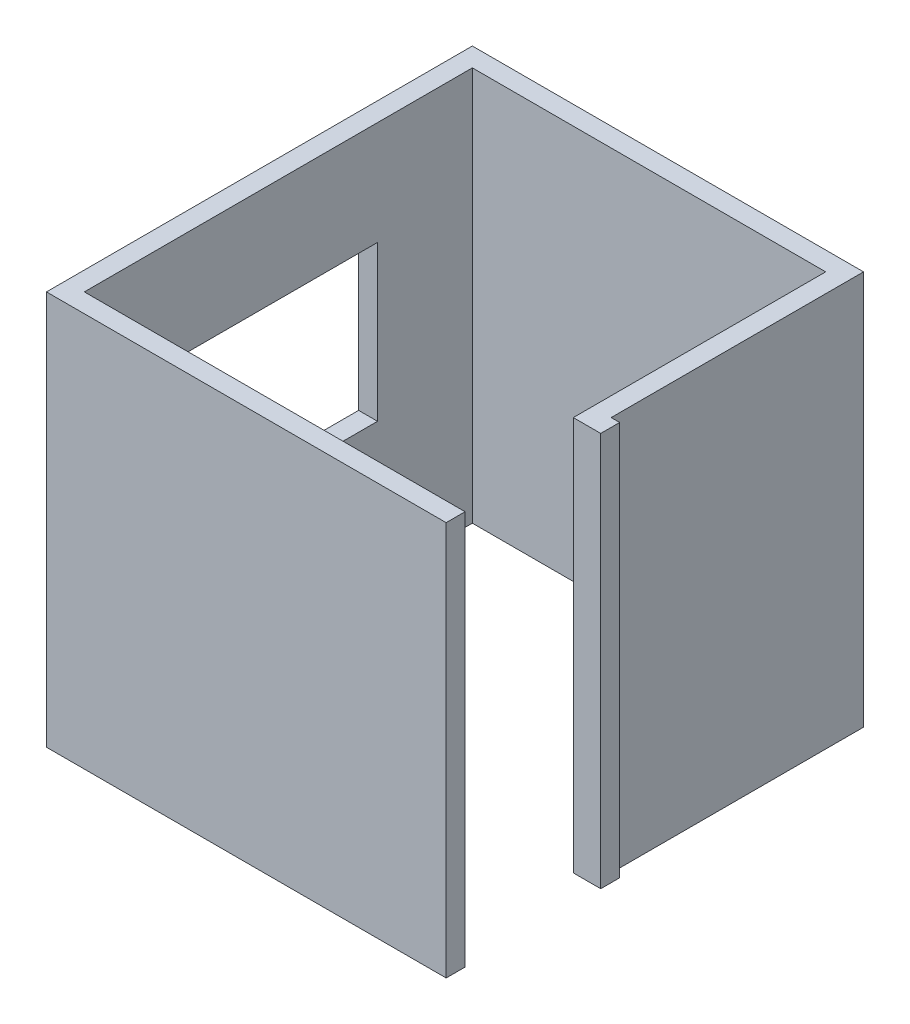
ISO-10303-21;
HEADER;
FILE_DESCRIPTION(('STEP AP214'),'2;1');
FILE_NAME('part.step','',(''),(''),'','','');
FILE_SCHEMA(('AUTOMOTIVE_DESIGN { 1 0 10303 214 1 1 1 1 }'));
ENDSEC;
DATA;
#1=APPLICATION_CONTEXT('core data for automotive mechanical design processes');
#2=APPLICATION_PROTOCOL_DEFINITION('international standard','automotive_design',2000,#1);
#3=PRODUCT_CONTEXT('',#1,'mechanical');
#4=PRODUCT('Part','Part','',(#3));
#5=PRODUCT_RELATED_PRODUCT_CATEGORY('part','',(#4));
#6=PRODUCT_DEFINITION_FORMATION('','',#4);
#7=PRODUCT_DEFINITION_CONTEXT('part definition',#1,'design');
#8=PRODUCT_DEFINITION('design','',#6,#7);
#9=PRODUCT_DEFINITION_SHAPE('','',#8);
#10=(LENGTH_UNIT() NAMED_UNIT(*) SI_UNIT(.MILLI.,.METRE.));
#11=(NAMED_UNIT(*) PLANE_ANGLE_UNIT() SI_UNIT($,.RADIAN.));
#12=(NAMED_UNIT(*) SI_UNIT($,.STERADIAN.) SOLID_ANGLE_UNIT());
#13=UNCERTAINTY_MEASURE_WITH_UNIT(LENGTH_MEASURE(1.E-05),#10,'distance_accuracy_value','');
#14=(GEOMETRIC_REPRESENTATION_CONTEXT(3) GLOBAL_UNCERTAINTY_ASSIGNED_CONTEXT((#13)) GLOBAL_UNIT_ASSIGNED_CONTEXT((#10,
#11,#12)) REPRESENTATION_CONTEXT('',''));
#15=CARTESIAN_POINT('',(0.,0.,0.));
#16=DIRECTION('',(0.,0.,1.));
#17=DIRECTION('',(1.,0.,0.));
#18=AXIS2_PLACEMENT_3D('',#15,#16,#17);
#19=CARTESIAN_POINT('',(0.,2500.,120.));
#20=DIRECTION('',(0.,0.,-1.));
#21=DIRECTION('',(-1.,0.,0.));
#22=AXIS2_PLACEMENT_3D('',#19,#20,#21);
#23=PLANE('',#22);
#24=DIRECTION('',(1.,0.,0.));
#25=VECTOR('',#24,1.);
#26=CARTESIAN_POINT('',(0.,0.,120.));
#27=LINE('',#26,#25);
#28=CARTESIAN_POINT('',(-120.,0.,120.));
#29=VERTEX_POINT('',#28);
#30=CARTESIAN_POINT('',(2413.94082575557,0.,120.));
#31=VERTEX_POINT('',#30);
#32=EDGE_CURVE('E172',#29,#31,#27,.T.);
#33=ORIENTED_EDGE('',*,*,#32,.T.);
#34=DIRECTION('',(0.,-1.,0.));
#35=VECTOR('',#34,1.);
#36=CARTESIAN_POINT('',(2413.94082575557,2500.,120.));
#37=LINE('',#36,#35);
#38=CARTESIAN_POINT('',(2413.94082575557,2500.,120.));
#39=VERTEX_POINT('',#38);
#40=EDGE_CURVE('E11',#39,#31,#37,.T.);
#41=ORIENTED_EDGE('',*,*,#40,.F.);
#42=DIRECTION('',(1.,0.,0.));
#43=VECTOR('',#42,1.);
#44=CARTESIAN_POINT('',(0.,2500.,120.));
#45=LINE('',#44,#43);
#46=CARTESIAN_POINT('',(-120.,2500.,120.));
#47=VERTEX_POINT('',#46);
#48=EDGE_CURVE('E182',#47,#39,#45,.T.);
#49=ORIENTED_EDGE('',*,*,#48,.F.);
#50=DIRECTION('',(0.,-1.,0.));
#51=VECTOR('',#50,1.);
#52=CARTESIAN_POINT('',(-120.,2500.,120.));
#53=LINE('',#52,#51);
#54=EDGE_CURVE('E214',#47,#29,#53,.T.);
#55=ORIENTED_EDGE('',*,*,#54,.T.);
#56=EDGE_LOOP('',(#33,#41,#49,#55));
#57=FACE_BOUND('',#56,.T.);
#58=ADVANCED_FACE('F36',(#57),#23,.F.);
#59=CARTESIAN_POINT('',(2413.94082575557,2500.,0.));
#60=DIRECTION('',(1.,0.,0.));
#61=DIRECTION('',(0.,0.,-1.));
#62=AXIS2_PLACEMENT_3D('',#59,#60,#61);
#63=PLANE('',#62);
#64=DIRECTION('',(0.,0.,1.));
#65=VECTOR('',#64,1.);
#66=CARTESIAN_POINT('',(2413.94082575557,0.,0.));
#67=LINE('',#66,#65);
#68=CARTESIAN_POINT('',(2413.94082575557,0.,0.));
#69=VERTEX_POINT('',#68);
#70=EDGE_CURVE('E217',#69,#31,#67,.T.);
#71=ORIENTED_EDGE('',*,*,#70,.F.);
#72=DIRECTION('',(0.,-1.,0.));
#73=VECTOR('',#72,1.);
#74=CARTESIAN_POINT('',(2413.94082575557,2500.,0.));
#75=LINE('',#74,#73);
#76=CARTESIAN_POINT('',(2413.94082575557,2500.,0.));
#77=VERTEX_POINT('',#76);
#78=EDGE_CURVE('E43',#77,#69,#75,.T.);
#79=ORIENTED_EDGE('',*,*,#78,.F.);
#80=DIRECTION('',(0.,0.,1.));
#81=VECTOR('',#80,1.);
#82=CARTESIAN_POINT('',(2413.94082575557,2500.,0.));
#83=LINE('',#82,#81);
#84=EDGE_CURVE('E184',#77,#39,#83,.T.);
#85=ORIENTED_EDGE('',*,*,#84,.T.);
#86=ORIENTED_EDGE('',*,*,#40,.T.);
#87=EDGE_LOOP('',(#71,#79,#85,#86));
#88=FACE_BOUND('',#87,.T.);
#89=ADVANCED_FACE('F274',(#88),#63,.T.);
#90=CARTESIAN_POINT('',(0.,2500.,0.));
#91=DIRECTION('',(0.,0.,-1.));
#92=DIRECTION('',(-1.,0.,0.));
#93=AXIS2_PLACEMENT_3D('',#90,#91,#92);
#94=PLANE('',#93);
#95=DIRECTION('',(1.,0.,0.));
#96=VECTOR('',#95,1.);
#97=CARTESIAN_POINT('',(0.,0.,0.));
#98=LINE('',#97,#96);
#99=CARTESIAN_POINT('',(0.,0.,0.));
#100=VERTEX_POINT('',#99);
#101=EDGE_CURVE('E220',#100,#69,#98,.T.);
#102=ORIENTED_EDGE('',*,*,#101,.F.);
#103=DIRECTION('',(0.,-1.,0.));
#104=VECTOR('',#103,1.);
#105=CARTESIAN_POINT('',(0.,2500.,0.));
#106=LINE('',#105,#104);
#107=CARTESIAN_POINT('',(0.,2500.,0.));
#108=VERTEX_POINT('',#107);
#109=EDGE_CURVE('E266',#108,#100,#106,.T.);
#110=ORIENTED_EDGE('',*,*,#109,.F.);
#111=DIRECTION('',(1.,0.,0.));
#112=VECTOR('',#111,1.);
#113=CARTESIAN_POINT('',(0.,2500.,0.));
#114=LINE('',#113,#112);
#115=EDGE_CURVE('E188',#108,#77,#114,.T.);
#116=ORIENTED_EDGE('',*,*,#115,.T.);
#117=ORIENTED_EDGE('',*,*,#78,.T.);
#118=EDGE_LOOP('',(#102,#110,#116,#117));
#119=FACE_BOUND('',#118,.T.);
#120=ADVANCED_FACE('F270',(#119),#94,.T.);
#121=CARTESIAN_POINT('',(0.,2500.,0.));
#122=DIRECTION('',(1.,0.,0.));
#123=DIRECTION('',(0.,0.,-1.));
#124=AXIS2_PLACEMENT_3D('',#121,#122,#123);
#125=PLANE('',#124);
#126=DIRECTION('',(0.,-1.,0.));
#127=VECTOR('',#126,1.);
#128=CARTESIAN_POINT('',(0.,1842.1460593985,-1859.));
#129=LINE('',#128,#127);
#130=CARTESIAN_POINT('',(0.,1842.1460593985,-1859.));
#131=VERTEX_POINT('',#130);
#132=CARTESIAN_POINT('',(0.,860.,-1859.));
#133=VERTEX_POINT('',#132);
#134=EDGE_CURVE('E161',#131,#133,#129,.T.);
#135=ORIENTED_EDGE('',*,*,#134,.T.);
#136=DIRECTION('',(0.,0.,1.));
#137=VECTOR('',#136,1.);
#138=CARTESIAN_POINT('',(0.,860.,-1859.));
#139=LINE('',#138,#137);
#140=CARTESIAN_POINT('',(0.,860.,-489.));
#141=VERTEX_POINT('',#140);
#142=EDGE_CURVE('E155',#133,#141,#139,.T.);
#143=ORIENTED_EDGE('',*,*,#142,.T.);
#144=DIRECTION('',(0.,1.,0.));
#145=VECTOR('',#144,1.);
#146=CARTESIAN_POINT('',(0.,1842.1460593985,-489.));
#147=LINE('',#146,#145);
#148=CARTESIAN_POINT('',(0.,1842.1460593985,-489.));
#149=VERTEX_POINT('',#148);
#150=EDGE_CURVE('E146',#141,#149,#147,.T.);
#151=ORIENTED_EDGE('',*,*,#150,.T.);
#152=DIRECTION('',(0.,0.,-1.));
#153=VECTOR('',#152,1.);
#154=CARTESIAN_POINT('',(0.,1842.1460593985,-1859.));
#155=LINE('',#154,#153);
#156=EDGE_CURVE('E164',#149,#131,#155,.T.);
#157=ORIENTED_EDGE('',*,*,#156,.T.);
#158=EDGE_LOOP('',(#135,#143,#151,#157));
#159=FACE_BOUND('',#158,.T.);
#160=DIRECTION('',(0.,0.,1.));
#161=VECTOR('',#160,1.);
#162=CARTESIAN_POINT('',(0.,0.,0.));
#163=LINE('',#162,#161);
#164=CARTESIAN_POINT('',(0.,0.,-2460.));
#165=VERTEX_POINT('',#164);
#166=EDGE_CURVE('E223',#165,#100,#163,.T.);
#167=ORIENTED_EDGE('',*,*,#166,.F.);
#168=DIRECTION('',(0.,-1.,0.));
#169=VECTOR('',#168,1.);
#170=CARTESIAN_POINT('',(0.,2500.,-2460.));
#171=LINE('',#170,#169);
#172=CARTESIAN_POINT('',(0.,2500.,-2460.));
#173=VERTEX_POINT('',#172);
#174=EDGE_CURVE('E264',#173,#165,#171,.T.);
#175=ORIENTED_EDGE('',*,*,#174,.F.);
#176=DIRECTION('',(0.,0.,1.));
#177=VECTOR('',#176,1.);
#178=CARTESIAN_POINT('',(0.,2500.,0.));
#179=LINE('',#178,#177);
#180=EDGE_CURVE('E191',#173,#108,#179,.T.);
#181=ORIENTED_EDGE('',*,*,#180,.T.);
#182=ORIENTED_EDGE('',*,*,#109,.T.);
#183=EDGE_LOOP('',(#167,#175,#181,#182));
#184=FACE_BOUND('',#183,.T.);
#185=ADVANCED_FACE('F159',(#159,#184),#125,.T.);
#186=CARTESIAN_POINT('',(0.,2500.,-2460.));
#187=DIRECTION('',(0.,0.,1.));
#188=DIRECTION('',(1.,0.,0.));
#189=AXIS2_PLACEMENT_3D('',#186,#187,#188);
#190=PLANE('',#189);
#191=DIRECTION('',(-1.,0.,0.));
#192=VECTOR('',#191,1.);
#193=CARTESIAN_POINT('',(0.,0.,-2460.));
#194=LINE('',#193,#192);
#195=CARTESIAN_POINT('',(2240.,0.,-2460.));
#196=VERTEX_POINT('',#195);
#197=EDGE_CURVE('E226',#196,#165,#194,.T.);
#198=ORIENTED_EDGE('',*,*,#197,.F.);
#199=DIRECTION('',(0.,-1.,0.));
#200=VECTOR('',#199,1.);
#201=CARTESIAN_POINT('',(2240.,2500.,-2460.));
#202=LINE('',#201,#200);
#203=CARTESIAN_POINT('',(2240.,2500.,-2460.));
#204=VERTEX_POINT('',#203);
#205=EDGE_CURVE('E262',#204,#196,#202,.T.);
#206=ORIENTED_EDGE('',*,*,#205,.F.);
#207=DIRECTION('',(-1.,0.,0.));
#208=VECTOR('',#207,1.);
#209=CARTESIAN_POINT('',(0.,2500.,-2460.));
#210=LINE('',#209,#208);
#211=EDGE_CURVE('E194',#204,#173,#210,.T.);
#212=ORIENTED_EDGE('',*,*,#211,.T.);
#213=ORIENTED_EDGE('',*,*,#174,.T.);
#214=EDGE_LOOP('',(#198,#206,#212,#213));
#215=FACE_BOUND('',#214,.T.);
#216=ADVANCED_FACE('F319',(#215),#190,.T.);
#217=CARTESIAN_POINT('',(2240.,2500.,-2460.));
#218=DIRECTION('',(-1.,0.,0.));
#219=DIRECTION('',(0.,0.,1.));
#220=AXIS2_PLACEMENT_3D('',#217,#218,#219);
#221=PLANE('',#220);
#222=DIRECTION('',(0.,0.,-1.));
#223=VECTOR('',#222,1.);
#224=CARTESIAN_POINT('',(2240.,0.,-2460.));
#225=LINE('',#224,#223);
#226=CARTESIAN_POINT('',(2240.,0.,-860.));
#227=VERTEX_POINT('',#226);
#228=EDGE_CURVE('E229',#227,#196,#225,.T.);
#229=ORIENTED_EDGE('',*,*,#228,.F.);
#230=DIRECTION('',(0.,-1.,0.));
#231=VECTOR('',#230,1.);
#232=CARTESIAN_POINT('',(2240.,2500.,-860.));
#233=LINE('',#232,#231);
#234=CARTESIAN_POINT('',(2240.,2500.,-860.));
#235=VERTEX_POINT('',#234);
#236=EDGE_CURVE('E260',#235,#227,#233,.T.);
#237=ORIENTED_EDGE('',*,*,#236,.F.);
#238=DIRECTION('',(0.,0.,-1.));
#239=VECTOR('',#238,1.);
#240=CARTESIAN_POINT('',(2240.,2500.,-2460.));
#241=LINE('',#240,#239);
#242=EDGE_CURVE('E197',#235,#204,#241,.T.);
#243=ORIENTED_EDGE('',*,*,#242,.T.);
#244=ORIENTED_EDGE('',*,*,#205,.T.);
#245=EDGE_LOOP('',(#229,#237,#243,#244));
#246=FACE_BOUND('',#245,.T.);
#247=ADVANCED_FACE('F316',(#246),#221,.T.);
#248=CARTESIAN_POINT('',(2240.,2500.,-860.));
#249=DIRECTION('',(0.,0.,1.));
#250=DIRECTION('',(1.,0.,0.));
#251=AXIS2_PLACEMENT_3D('',#248,#249,#250);
#252=PLANE('',#251);
#253=DIRECTION('',(-1.,0.,0.));
#254=VECTOR('',#253,1.);
#255=CARTESIAN_POINT('',(2240.,0.,-860.));
#256=LINE('',#255,#254);
#257=CARTESIAN_POINT('',(2413.94082575557,0.,-860.));
#258=VERTEX_POINT('',#257);
#259=EDGE_CURVE('E232',#258,#227,#256,.T.);
#260=ORIENTED_EDGE('',*,*,#259,.F.);
#261=DIRECTION('',(0.,-1.,0.));
#262=VECTOR('',#261,1.);
#263=CARTESIAN_POINT('',(2413.94082575557,2500.,-860.));
#264=LINE('',#263,#262);
#265=CARTESIAN_POINT('',(2413.94082575557,2500.,-860.));
#266=VERTEX_POINT('',#265);
#267=EDGE_CURVE('E258',#266,#258,#264,.T.);
#268=ORIENTED_EDGE('',*,*,#267,.F.);
#269=DIRECTION('',(-1.,0.,0.));
#270=VECTOR('',#269,1.);
#271=CARTESIAN_POINT('',(2240.,2500.,-860.));
#272=LINE('',#271,#270);
#273=EDGE_CURVE('E200',#266,#235,#272,.T.);
#274=ORIENTED_EDGE('',*,*,#273,.T.);
#275=ORIENTED_EDGE('',*,*,#236,.T.);
#276=EDGE_LOOP('',(#260,#268,#274,#275));
#277=FACE_BOUND('',#276,.T.);
#278=ADVANCED_FACE('F313',(#277),#252,.T.);
#279=CARTESIAN_POINT('',(2413.94082575557,2500.,-980.));
#280=DIRECTION('',(1.,0.,0.));
#281=DIRECTION('',(0.,0.,-1.));
#282=AXIS2_PLACEMENT_3D('',#279,#280,#281);
#283=PLANE('',#282);
#284=DIRECTION('',(0.,0.,1.));
#285=VECTOR('',#284,1.);
#286=CARTESIAN_POINT('',(2413.94082575557,0.,-980.));
#287=LINE('',#286,#285);
#288=CARTESIAN_POINT('',(2413.94082575557,0.,-980.));
#289=VERTEX_POINT('',#288);
#290=EDGE_CURVE('E235',#289,#258,#287,.T.);
#291=ORIENTED_EDGE('',*,*,#290,.F.);
#292=DIRECTION('',(0.,-1.,0.));
#293=VECTOR('',#292,1.);
#294=CARTESIAN_POINT('',(2413.94082575557,2500.,-980.));
#295=LINE('',#294,#293);
#296=CARTESIAN_POINT('',(2413.94082575557,2500.,-980.));
#297=VERTEX_POINT('',#296);
#298=EDGE_CURVE('E256',#297,#289,#295,.T.);
#299=ORIENTED_EDGE('',*,*,#298,.F.);
#300=DIRECTION('',(0.,0.,1.));
#301=VECTOR('',#300,1.);
#302=CARTESIAN_POINT('',(2413.94082575557,2500.,-980.));
#303=LINE('',#302,#301);
#304=EDGE_CURVE('E203',#297,#266,#303,.T.);
#305=ORIENTED_EDGE('',*,*,#304,.T.);
#306=ORIENTED_EDGE('',*,*,#267,.T.);
#307=EDGE_LOOP('',(#291,#299,#305,#306));
#308=FACE_BOUND('',#307,.T.);
#309=ADVANCED_FACE('F307',(#308),#283,.T.);
#310=CARTESIAN_POINT('',(2240.,2500.,-980.));
#311=DIRECTION('',(0.,0.,1.));
#312=DIRECTION('',(1.,0.,0.));
#313=AXIS2_PLACEMENT_3D('',#310,#311,#312);
#314=PLANE('',#313);
#315=DIRECTION('',(1.,0.,0.));
#316=VECTOR('',#315,1.);
#317=CARTESIAN_POINT('',(2240.,0.,-980.));
#318=LINE('',#317,#316);
#319=CARTESIAN_POINT('',(2360.,0.,-980.));
#320=VERTEX_POINT('',#319);
#321=EDGE_CURVE('E238',#289,#320,#318,.F.);
#322=ORIENTED_EDGE('',*,*,#321,.T.);
#323=DIRECTION('',(0.,-1.,0.));
#324=VECTOR('',#323,1.);
#325=CARTESIAN_POINT('',(2360.,2500.,-980.));
#326=LINE('',#325,#324);
#327=CARTESIAN_POINT('',(2360.,2500.,-980.));
#328=VERTEX_POINT('',#327);
#329=EDGE_CURVE('E253',#328,#320,#326,.T.);
#330=ORIENTED_EDGE('',*,*,#329,.F.);
#331=DIRECTION('',(1.,0.,0.));
#332=VECTOR('',#331,1.);
#333=CARTESIAN_POINT('',(2240.,2500.,-980.));
#334=LINE('',#333,#332);
#335=EDGE_CURVE('E206',#297,#328,#334,.F.);
#336=ORIENTED_EDGE('',*,*,#335,.F.);
#337=ORIENTED_EDGE('',*,*,#298,.T.);
#338=EDGE_LOOP('',(#322,#330,#336,#337));
#339=FACE_BOUND('',#338,.T.);
#340=ADVANCED_FACE('F320',(#339),#314,.F.);
#341=CARTESIAN_POINT('',(2360.,2500.,-2460.));
#342=DIRECTION('',(-1.,0.,0.));
#343=DIRECTION('',(0.,0.,1.));
#344=AXIS2_PLACEMENT_3D('',#341,#342,#343);
#345=PLANE('',#344);
#346=DIRECTION('',(0.,0.,-1.));
#347=VECTOR('',#346,1.);
#348=CARTESIAN_POINT('',(2360.,0.,-2460.));
#349=LINE('',#348,#347);
#350=CARTESIAN_POINT('',(2360.,0.,-2580.));
#351=VERTEX_POINT('',#350);
#352=EDGE_CURVE('E240',#320,#351,#349,.T.);
#353=ORIENTED_EDGE('',*,*,#352,.T.);
#354=DIRECTION('',(0.,-1.,0.));
#355=VECTOR('',#354,1.);
#356=CARTESIAN_POINT('',(2360.,2500.,-2580.));
#357=LINE('',#356,#355);
#358=CARTESIAN_POINT('',(2360.,2500.,-2580.));
#359=VERTEX_POINT('',#358);
#360=EDGE_CURVE('E250',#359,#351,#357,.T.);
#361=ORIENTED_EDGE('',*,*,#360,.F.);
#362=DIRECTION('',(0.,0.,-1.));
#363=VECTOR('',#362,1.);
#364=CARTESIAN_POINT('',(2360.,2500.,-2460.));
#365=LINE('',#364,#363);
#366=EDGE_CURVE('E208',#328,#359,#365,.T.);
#367=ORIENTED_EDGE('',*,*,#366,.F.);
#368=ORIENTED_EDGE('',*,*,#329,.T.);
#369=EDGE_LOOP('',(#353,#361,#367,#368));
#370=FACE_BOUND('',#369,.T.);
#371=ADVANCED_FACE('F301',(#370),#345,.F.);
#372=CARTESIAN_POINT('',(0.,2500.,-2580.));
#373=DIRECTION('',(0.,0.,1.));
#374=DIRECTION('',(1.,0.,0.));
#375=AXIS2_PLACEMENT_3D('',#372,#373,#374);
#376=PLANE('',#375);
#377=DIRECTION('',(1.,0.,0.));
#378=VECTOR('',#377,1.);
#379=CARTESIAN_POINT('',(0.,0.,-2580.));
#380=LINE('',#379,#378);
#381=CARTESIAN_POINT('',(-120.,0.,-2580.));
#382=VERTEX_POINT('',#381);
#383=EDGE_CURVE('E242',#351,#382,#380,.F.);
#384=ORIENTED_EDGE('',*,*,#383,.T.);
#385=DIRECTION('',(0.,-1.,0.));
#386=VECTOR('',#385,1.);
#387=CARTESIAN_POINT('',(-120.,2500.,-2580.));
#388=LINE('',#387,#386);
#389=CARTESIAN_POINT('',(-120.,2500.,-2580.));
#390=VERTEX_POINT('',#389);
#391=EDGE_CURVE('E247',#390,#382,#388,.T.);
#392=ORIENTED_EDGE('',*,*,#391,.F.);
#393=DIRECTION('',(1.,0.,0.));
#394=VECTOR('',#393,1.);
#395=CARTESIAN_POINT('',(0.,2500.,-2580.));
#396=LINE('',#395,#394);
#397=EDGE_CURVE('E210',#359,#390,#396,.F.);
#398=ORIENTED_EDGE('',*,*,#397,.F.);
#399=ORIENTED_EDGE('',*,*,#360,.T.);
#400=EDGE_LOOP('',(#384,#392,#398,#399));
#401=FACE_BOUND('',#400,.T.);
#402=ADVANCED_FACE('F297',(#401),#376,.F.);
#403=CARTESIAN_POINT('',(-120.,2500.,0.));
#404=DIRECTION('',(1.,0.,0.));
#405=DIRECTION('',(0.,0.,-1.));
#406=AXIS2_PLACEMENT_3D('',#403,#404,#405);
#407=PLANE('',#406);
#408=DIRECTION('',(0.,0.,1.));
#409=VECTOR('',#408,1.);
#410=CARTESIAN_POINT('',(-120.,860.,-1859.));
#411=LINE('',#410,#409);
#412=CARTESIAN_POINT('',(-120.,860.,-1859.));
#413=VERTEX_POINT('',#412);
#414=CARTESIAN_POINT('',(-120.,860.,-489.));
#415=VERTEX_POINT('',#414);
#416=EDGE_CURVE('E58',#413,#415,#411,.T.);
#417=ORIENTED_EDGE('',*,*,#416,.F.);
#418=DIRECTION('',(0.,-1.,0.));
#419=VECTOR('',#418,1.);
#420=CARTESIAN_POINT('',(-120.,1842.1460593985,-1859.));
#421=LINE('',#420,#419);
#422=CARTESIAN_POINT('',(-120.,1842.1460593985,-1859.));
#423=VERTEX_POINT('',#422);
#424=EDGE_CURVE('E168',#423,#413,#421,.T.);
#425=ORIENTED_EDGE('',*,*,#424,.F.);
#426=DIRECTION('',(0.,0.,-1.));
#427=VECTOR('',#426,1.);
#428=CARTESIAN_POINT('',(-120.,1842.1460593985,-1859.));
#429=LINE('',#428,#427);
#430=CARTESIAN_POINT('',(-120.,1842.1460593985,-489.));
#431=VERTEX_POINT('',#430);
#432=EDGE_CURVE('E169',#431,#423,#429,.T.);
#433=ORIENTED_EDGE('',*,*,#432,.F.);
#434=DIRECTION('',(0.,1.,0.));
#435=VECTOR('',#434,1.);
#436=CARTESIAN_POINT('',(-120.,1842.1460593985,-489.));
#437=LINE('',#436,#435);
#438=EDGE_CURVE('E173',#415,#431,#437,.T.);
#439=ORIENTED_EDGE('',*,*,#438,.F.);
#440=EDGE_LOOP('',(#417,#425,#433,#439));
#441=FACE_BOUND('',#440,.T.);
#442=DIRECTION('',(0.,0.,-1.));
#443=VECTOR('',#442,1.);
#444=CARTESIAN_POINT('',(-120.,0.,0.));
#445=LINE('',#444,#443);
#446=EDGE_CURVE('E185',#382,#29,#445,.F.);
#447=ORIENTED_EDGE('',*,*,#446,.T.);
#448=ORIENTED_EDGE('',*,*,#54,.F.);
#449=DIRECTION('',(0.,0.,-1.));
#450=VECTOR('',#449,1.);
#451=CARTESIAN_POINT('',(-120.,2500.,0.));
#452=LINE('',#451,#450);
#453=EDGE_CURVE('E212',#390,#47,#452,.F.);
#454=ORIENTED_EDGE('',*,*,#453,.F.);
#455=ORIENTED_EDGE('',*,*,#391,.T.);
#456=EDGE_LOOP('',(#447,#448,#454,#455));
#457=FACE_BOUND('',#456,.T.);
#458=ADVANCED_FACE('F293',(#441,#457),#407,.F.);
#459=CARTESIAN_POINT('',(0.,2500.,0.));
#460=DIRECTION('',(0.,-1.,0.));
#461=DIRECTION('',(-1.,0.,0.));
#462=AXIS2_PLACEMENT_3D('',#459,#460,#461);
#463=PLANE('',#462);
#464=ORIENTED_EDGE('',*,*,#48,.T.);
#465=ORIENTED_EDGE('',*,*,#84,.F.);
#466=ORIENTED_EDGE('',*,*,#115,.F.);
#467=ORIENTED_EDGE('',*,*,#180,.F.);
#468=ORIENTED_EDGE('',*,*,#211,.F.);
#469=ORIENTED_EDGE('',*,*,#242,.F.);
#470=ORIENTED_EDGE('',*,*,#273,.F.);
#471=ORIENTED_EDGE('',*,*,#304,.F.);
#472=ORIENTED_EDGE('',*,*,#335,.T.);
#473=ORIENTED_EDGE('',*,*,#366,.T.);
#474=ORIENTED_EDGE('',*,*,#397,.T.);
#475=ORIENTED_EDGE('',*,*,#453,.T.);
#476=EDGE_LOOP('',(#464,#465,#466,#467,#468,#469,#470,#471,#472,#473,#474,#475));
#477=FACE_BOUND('',#476,.T.);
#478=ADVANCED_FACE('F283',(#477),#463,.F.);
#479=CARTESIAN_POINT('',(0.,0.,0.));
#480=DIRECTION('',(0.,-1.,0.));
#481=DIRECTION('',(-1.,0.,0.));
#482=AXIS2_PLACEMENT_3D('',#479,#480,#481);
#483=PLANE('',#482);
#484=ORIENTED_EDGE('',*,*,#32,.F.);
#485=ORIENTED_EDGE('',*,*,#446,.F.);
#486=ORIENTED_EDGE('',*,*,#383,.F.);
#487=ORIENTED_EDGE('',*,*,#352,.F.);
#488=ORIENTED_EDGE('',*,*,#321,.F.);
#489=ORIENTED_EDGE('',*,*,#290,.T.);
#490=ORIENTED_EDGE('',*,*,#259,.T.);
#491=ORIENTED_EDGE('',*,*,#228,.T.);
#492=ORIENTED_EDGE('',*,*,#197,.T.);
#493=ORIENTED_EDGE('',*,*,#166,.T.);
#494=ORIENTED_EDGE('',*,*,#101,.T.);
#495=ORIENTED_EDGE('',*,*,#70,.T.);
#496=EDGE_LOOP('',(#484,#485,#486,#487,#488,#489,#490,#491,#492,#493,#494,#495));
#497=FACE_BOUND('',#496,.T.);
#498=ADVANCED_FACE('F278',(#497),#483,.T.);
#499=CARTESIAN_POINT('',(2413.94182575557,1842.1460593985,-1859.));
#500=DIRECTION('',(0.,0.,-1.));
#501=DIRECTION('',(0.,1.,0.));
#502=AXIS2_PLACEMENT_3D('',#499,#500,#501);
#503=PLANE('',#502);
#504=DIRECTION('',(-1.,0.,0.));
#505=VECTOR('',#504,1.);
#506=CARTESIAN_POINT('',(2413.94182575557,1842.1460593985,-1859.));
#507=LINE('',#506,#505);
#508=EDGE_CURVE('E162',#131,#423,#507,.T.);
#509=ORIENTED_EDGE('',*,*,#508,.T.);
#510=ORIENTED_EDGE('',*,*,#424,.T.);
#511=DIRECTION('',(-1.,0.,0.));
#512=VECTOR('',#511,1.);
#513=CARTESIAN_POINT('',(2413.94182575557,860.,-1859.));
#514=LINE('',#513,#512);
#515=EDGE_CURVE('E179',#133,#413,#514,.T.);
#516=ORIENTED_EDGE('',*,*,#515,.F.);
#517=ORIENTED_EDGE('',*,*,#134,.F.);
#518=EDGE_LOOP('',(#509,#510,#516,#517));
#519=FACE_BOUND('',#518,.T.);
#520=ADVANCED_FACE('F390',(#519),#503,.F.);
#521=CARTESIAN_POINT('',(2413.94182575557,1842.1460593985,-1859.));
#522=DIRECTION('',(0.,1.,0.));
#523=DIRECTION('',(0.,0.,1.));
#524=AXIS2_PLACEMENT_3D('',#521,#522,#523);
#525=PLANE('',#524);
#526=DIRECTION('',(-1.,0.,0.));
#527=VECTOR('',#526,1.);
#528=CARTESIAN_POINT('',(2413.94182575557,1842.1460593985,-489.));
#529=LINE('',#528,#527);
#530=EDGE_CURVE('E50',#149,#431,#529,.T.);
#531=ORIENTED_EDGE('',*,*,#530,.T.);
#532=ORIENTED_EDGE('',*,*,#432,.T.);
#533=ORIENTED_EDGE('',*,*,#508,.F.);
#534=ORIENTED_EDGE('',*,*,#156,.F.);
#535=EDGE_LOOP('',(#531,#532,#533,#534));
#536=FACE_BOUND('',#535,.T.);
#537=ADVANCED_FACE('F414',(#536),#525,.F.);
#538=CARTESIAN_POINT('',(2413.94182575557,860.,-1859.));
#539=DIRECTION('',(0.,-1.,0.));
#540=DIRECTION('',(0.,0.,-1.));
#541=AXIS2_PLACEMENT_3D('',#538,#539,#540);
#542=PLANE('',#541);
#543=ORIENTED_EDGE('',*,*,#515,.T.);
#544=ORIENTED_EDGE('',*,*,#416,.T.);
#545=DIRECTION('',(-1.,0.,0.));
#546=VECTOR('',#545,1.);
#547=CARTESIAN_POINT('',(2413.94182575557,860.,-489.));
#548=LINE('',#547,#546);
#549=EDGE_CURVE('E148',#141,#415,#548,.T.);
#550=ORIENTED_EDGE('',*,*,#549,.F.);
#551=ORIENTED_EDGE('',*,*,#142,.F.);
#552=EDGE_LOOP('',(#543,#544,#550,#551));
#553=FACE_BOUND('',#552,.T.);
#554=ADVANCED_FACE('F154',(#553),#542,.F.);
#555=CARTESIAN_POINT('',(2413.94182575557,1842.1460593985,-489.));
#556=DIRECTION('',(0.,0.,1.));
#557=DIRECTION('',(0.,-1.,0.));
#558=AXIS2_PLACEMENT_3D('',#555,#556,#557);
#559=PLANE('',#558);
#560=ORIENTED_EDGE('',*,*,#549,.T.);
#561=ORIENTED_EDGE('',*,*,#438,.T.);
#562=ORIENTED_EDGE('',*,*,#530,.F.);
#563=ORIENTED_EDGE('',*,*,#150,.F.);
#564=EDGE_LOOP('',(#560,#561,#562,#563));
#565=FACE_BOUND('',#564,.T.);
#566=ADVANCED_FACE('F147',(#565),#559,.F.);
#567=CLOSED_SHELL('',(#58,#89,#120,#185,#216,#247,#278,#309,#340,#371,#402,#458,#478,#498,#520,
#537,#554,#566));
#568=MANIFOLD_SOLID_BREP('B2',#567);
#569=ADVANCED_BREP_SHAPE_REPRESENTATION('',(#18,#568),#14);
#570=SHAPE_DEFINITION_REPRESENTATION(#9,#569);
ENDSEC;
END-ISO-10303-21;
